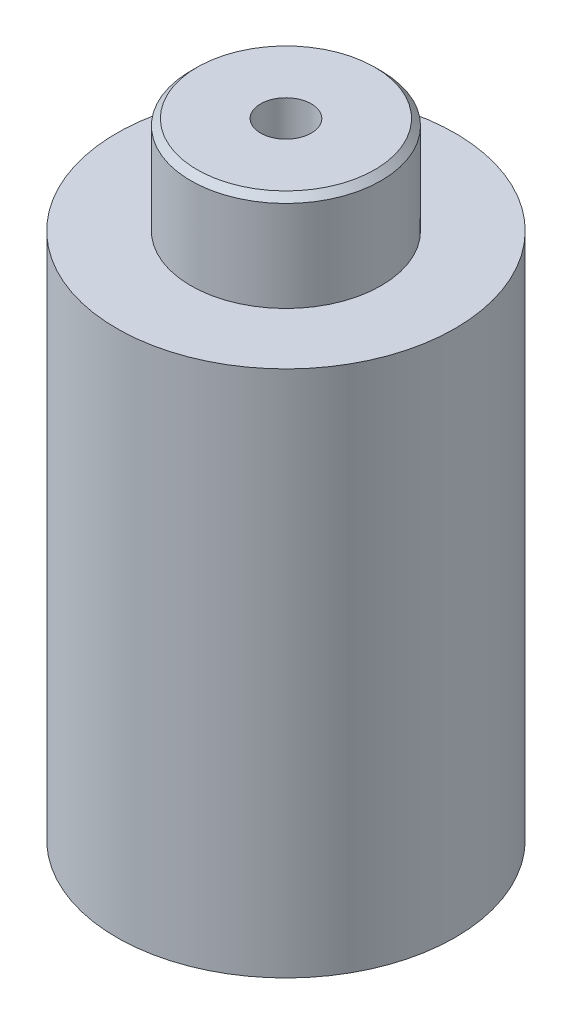
ISO-10303-21;
HEADER;
FILE_DESCRIPTION(('STEP AP214'),'2;1');
FILE_NAME('part.step','',(''),(''),'','','');
FILE_SCHEMA(('AUTOMOTIVE_DESIGN { 1 0 10303 214 1 1 1 1 }'));
ENDSEC;
DATA;
#1=APPLICATION_CONTEXT('core data for automotive mechanical design processes');
#2=APPLICATION_PROTOCOL_DEFINITION('international standard','automotive_design',2000,#1);
#3=PRODUCT_CONTEXT('',#1,'mechanical');
#4=PRODUCT('Part','Part','',(#3));
#5=PRODUCT_RELATED_PRODUCT_CATEGORY('part','',(#4));
#6=PRODUCT_DEFINITION_FORMATION('','',#4);
#7=PRODUCT_DEFINITION_CONTEXT('part definition',#1,'design');
#8=PRODUCT_DEFINITION('design','',#6,#7);
#9=PRODUCT_DEFINITION_SHAPE('','',#8);
#10=(LENGTH_UNIT() NAMED_UNIT(*) SI_UNIT(.MILLI.,.METRE.));
#11=(NAMED_UNIT(*) PLANE_ANGLE_UNIT() SI_UNIT($,.RADIAN.));
#12=(NAMED_UNIT(*) SI_UNIT($,.STERADIAN.) SOLID_ANGLE_UNIT());
#13=UNCERTAINTY_MEASURE_WITH_UNIT(LENGTH_MEASURE(1.E-05),#10,'distance_accuracy_value','');
#14=(GEOMETRIC_REPRESENTATION_CONTEXT(3) GLOBAL_UNCERTAINTY_ASSIGNED_CONTEXT((#13)) GLOBAL_UNIT_ASSIGNED_CONTEXT((#10,
#11,#12)) REPRESENTATION_CONTEXT('',''));
#15=CARTESIAN_POINT('',(0.,0.,0.));
#16=DIRECTION('',(0.,0.,1.));
#17=DIRECTION('',(1.,0.,0.));
#18=AXIS2_PLACEMENT_3D('',#15,#16,#17);
#19=CARTESIAN_POINT('',(-2.25000000000001,26.7273603486889,0.));
#20=DIRECTION('',(0.,-1.,0.));
#21=DIRECTION('',(1.,0.,0.));
#22=AXIS2_PLACEMENT_3D('',#19,#20,#21);
#23=PLANE('',#22);
#24=CARTESIAN_POINT('',(0.,26.7273603486728,0.));
#25=DIRECTION('',(0.,-1.,0.));
#26=DIRECTION('',(0.,0.,-1.));
#27=AXIS2_PLACEMENT_3D('',#24,#25,#26);
#28=CIRCLE('',#27,2.09999999998445);
#29=CARTESIAN_POINT('',(0.,26.7273603486728,-2.09999999998445));
#30=VERTEX_POINT('',#29);
#31=EDGE_CURVE('E17',#30,#30,#28,.T.);
#32=ORIENTED_EDGE('',*,*,#31,.F.);
#33=EDGE_LOOP('',(#32));
#34=FACE_BOUND('',#33,.T.);
#35=CARTESIAN_POINT('',(0.,26.7273603486889,0.));
#36=DIRECTION('',(0.,-1.,0.));
#37=DIRECTION('',(1.,0.,0.));
#38=AXIS2_PLACEMENT_3D('',#35,#36,#37);
#39=CIRCLE('',#38,0.600000000000003);
#40=CARTESIAN_POINT('',(0.600000000000003,26.7273603486889,0.));
#41=VERTEX_POINT('',#40);
#42=EDGE_CURVE('E37',#41,#41,#39,.T.);
#43=ORIENTED_EDGE('',*,*,#42,.T.);
#44=EDGE_LOOP('',(#43));
#45=FACE_BOUND('',#44,.T.);
#46=ADVANCED_FACE('F14',(#34,#45),#23,.F.);
#47=CARTESIAN_POINT('',(0.,26.5773603487105,0.));
#48=DIRECTION('',(0.,-1.,0.));
#49=DIRECTION('',(0.,0.,-1.));
#50=AXIS2_PLACEMENT_3D('',#47,#48,#49);
#51=CONICAL_SURFACE('',#50,2.24999999994679,0.785398163397448);
#52=CARTESIAN_POINT('',(0.,26.5773603486889,0.));
#53=DIRECTION('',(0.,-1.,0.));
#54=DIRECTION('',(1.,0.,0.));
#55=AXIS2_PLACEMENT_3D('',#52,#53,#54);
#56=CIRCLE('',#55,2.25000000000001);
#57=CARTESIAN_POINT('',(2.25000000000001,26.5773603486889,0.));
#58=VERTEX_POINT('',#57);
#59=EDGE_CURVE('E29',#58,#58,#56,.T.);
#60=ORIENTED_EDGE('',*,*,#59,.F.);
#61=EDGE_LOOP('',(#60));
#62=FACE_BOUND('',#61,.T.);
#63=ORIENTED_EDGE('',*,*,#31,.T.);
#64=EDGE_LOOP('',(#63));
#65=FACE_BOUND('',#64,.T.);
#66=ADVANCED_FACE('F45',(#62,#65),#51,.T.);
#67=CARTESIAN_POINT('',(0.,0.,0.));
#68=DIRECTION('',(0.,-1.,0.));
#69=DIRECTION('',(1.,0.,0.));
#70=AXIS2_PLACEMENT_3D('',#67,#68,#69);
#71=CYLINDRICAL_SURFACE('',#70,0.600000000000003);
#72=ORIENTED_EDGE('',*,*,#42,.F.);
#73=EDGE_LOOP('',(#72));
#74=FACE_BOUND('',#73,.T.);
#75=CARTESIAN_POINT('',(0.,17.5174040945762,0.));
#76=DIRECTION('',(0.,-1.,0.));
#77=DIRECTION('',(1.,0.,0.));
#78=AXIS2_PLACEMENT_3D('',#75,#76,#77);
#79=CIRCLE('',#78,0.600000000019929);
#80=CARTESIAN_POINT('',(0.600000000019918,17.5174040945762,0.));
#81=VERTEX_POINT('',#80);
#82=EDGE_CURVE('E36',#81,#81,#79,.T.);
#83=ORIENTED_EDGE('',*,*,#82,.T.);
#84=EDGE_LOOP('',(#83));
#85=FACE_BOUND('',#84,.T.);
#86=ADVANCED_FACE('F52',(#74,#85),#71,.F.);
#87=CARTESIAN_POINT('',(0.,0.,0.));
#88=DIRECTION('',(0.,-1.,0.));
#89=DIRECTION('',(1.,0.,0.));
#90=AXIS2_PLACEMENT_3D('',#87,#88,#89);
#91=CYLINDRICAL_SURFACE('',#90,2.25000000000001);
#92=ORIENTED_EDGE('',*,*,#59,.T.);
#93=EDGE_LOOP('',(#92));
#94=FACE_BOUND('',#93,.T.);
#95=CARTESIAN_POINT('',(0.,24.4273603486889,0.));
#96=DIRECTION('',(0.,-1.,0.));
#97=DIRECTION('',(1.,0.,0.));
#98=AXIS2_PLACEMENT_3D('',#95,#96,#97);
#99=CIRCLE('',#98,2.25000000000001);
#100=CARTESIAN_POINT('',(2.25000000000001,24.4273603486889,0.));
#101=VERTEX_POINT('',#100);
#102=EDGE_CURVE('E34',#101,#101,#99,.F.);
#103=ORIENTED_EDGE('',*,*,#102,.T.);
#104=EDGE_LOOP('',(#103));
#105=FACE_BOUND('',#104,.T.);
#106=ADVANCED_FACE('F72',(#94,#105),#91,.T.);
#107=CARTESIAN_POINT('',(0.,11.9573603486174,0.));
#108=DIRECTION('',(0.,-1.,0.));
#109=DIRECTION('',(0.,0.,-1.));
#110=AXIS2_PLACEMENT_3D('',#107,#108,#109);
#111=CONICAL_SURFACE('',#110,3.90000000004421,0.535641547436962);
#112=ORIENTED_EDGE('',*,*,#82,.F.);
#113=EDGE_LOOP('',(#112));
#114=FACE_BOUND('',#113,.T.);
#115=CARTESIAN_POINT('',(0.,11.9573603486174,0.));
#116=DIRECTION('',(0.,-1.,0.));
#117=DIRECTION('',(0.,0.,-1.));
#118=AXIS2_PLACEMENT_3D('',#115,#116,#117);
#119=CIRCLE('',#118,3.90000000004421);
#120=CARTESIAN_POINT('',(0.,11.9573603486174,-3.90000000004421));
#121=VERTEX_POINT('',#120);
#122=EDGE_CURVE('E26',#121,#121,#119,.T.);
#123=ORIENTED_EDGE('',*,*,#122,.T.);
#124=EDGE_LOOP('',(#123));
#125=FACE_BOUND('',#124,.T.);
#126=ADVANCED_FACE('F68',(#114,#125),#111,.F.);
#127=CARTESIAN_POINT('',(-2.25,24.4273603486889,0.));
#128=DIRECTION('',(0.,-1.,0.));
#129=DIRECTION('',(1.,0.,0.));
#130=AXIS2_PLACEMENT_3D('',#127,#128,#129);
#131=PLANE('',#130);
#132=CARTESIAN_POINT('',(0.,24.4273603486889,0.));
#133=DIRECTION('',(0.,-1.,0.));
#134=DIRECTION('',(1.,0.,0.));
#135=AXIS2_PLACEMENT_3D('',#132,#133,#134);
#136=CIRCLE('',#135,4.00000000000002);
#137=CARTESIAN_POINT('',(4.00000000000002,24.4273603486889,0.));
#138=VERTEX_POINT('',#137);
#139=EDGE_CURVE('E21',#138,#138,#136,.T.);
#140=ORIENTED_EDGE('',*,*,#139,.F.);
#141=EDGE_LOOP('',(#140));
#142=FACE_BOUND('',#141,.T.);
#143=ORIENTED_EDGE('',*,*,#102,.F.);
#144=EDGE_LOOP('',(#143));
#145=FACE_BOUND('',#144,.T.);
#146=ADVANCED_FACE('F61',(#142,#145),#131,.F.);
#147=CARTESIAN_POINT('',(-4.00000000000002,11.9573603486889,0.));
#148=DIRECTION('',(0.,1.,0.));
#149=DIRECTION('',(-1.,0.,0.));
#150=AXIS2_PLACEMENT_3D('',#147,#148,#149);
#151=PLANE('',#150);
#152=ORIENTED_EDGE('',*,*,#122,.F.);
#153=EDGE_LOOP('',(#152));
#154=FACE_BOUND('',#153,.T.);
#155=CARTESIAN_POINT('',(0.,11.9573603486889,0.));
#156=DIRECTION('',(0.,-1.,0.));
#157=DIRECTION('',(1.,0.,0.));
#158=AXIS2_PLACEMENT_3D('',#155,#156,#157);
#159=CIRCLE('',#158,4.00000000000002);
#160=CARTESIAN_POINT('',(4.00000000000002,11.9573603486889,0.));
#161=VERTEX_POINT('',#160);
#162=EDGE_CURVE('E10',#161,#161,#159,.F.);
#163=ORIENTED_EDGE('',*,*,#162,.F.);
#164=EDGE_LOOP('',(#163));
#165=FACE_BOUND('',#164,.T.);
#166=ADVANCED_FACE('F56',(#154,#165),#151,.F.);
#167=CARTESIAN_POINT('',(0.,0.,0.));
#168=DIRECTION('',(0.,-1.,0.));
#169=DIRECTION('',(1.,0.,0.));
#170=AXIS2_PLACEMENT_3D('',#167,#168,#169);
#171=CYLINDRICAL_SURFACE('',#170,4.00000000000002);
#172=ORIENTED_EDGE('',*,*,#162,.T.);
#173=EDGE_LOOP('',(#172));
#174=FACE_BOUND('',#173,.T.);
#175=ORIENTED_EDGE('',*,*,#139,.T.);
#176=EDGE_LOOP('',(#175));
#177=FACE_BOUND('',#176,.T.);
#178=ADVANCED_FACE('F54',(#174,#177),#171,.T.);
#179=CLOSED_SHELL('',(#46,#66,#86,#106,#126,#146,#166,#178));
#180=MANIFOLD_SOLID_BREP('B1',#179);
#181=ADVANCED_BREP_SHAPE_REPRESENTATION('',(#18,#180),#14);
#182=SHAPE_DEFINITION_REPRESENTATION(#9,#181);
ENDSEC;
END-ISO-10303-21;
